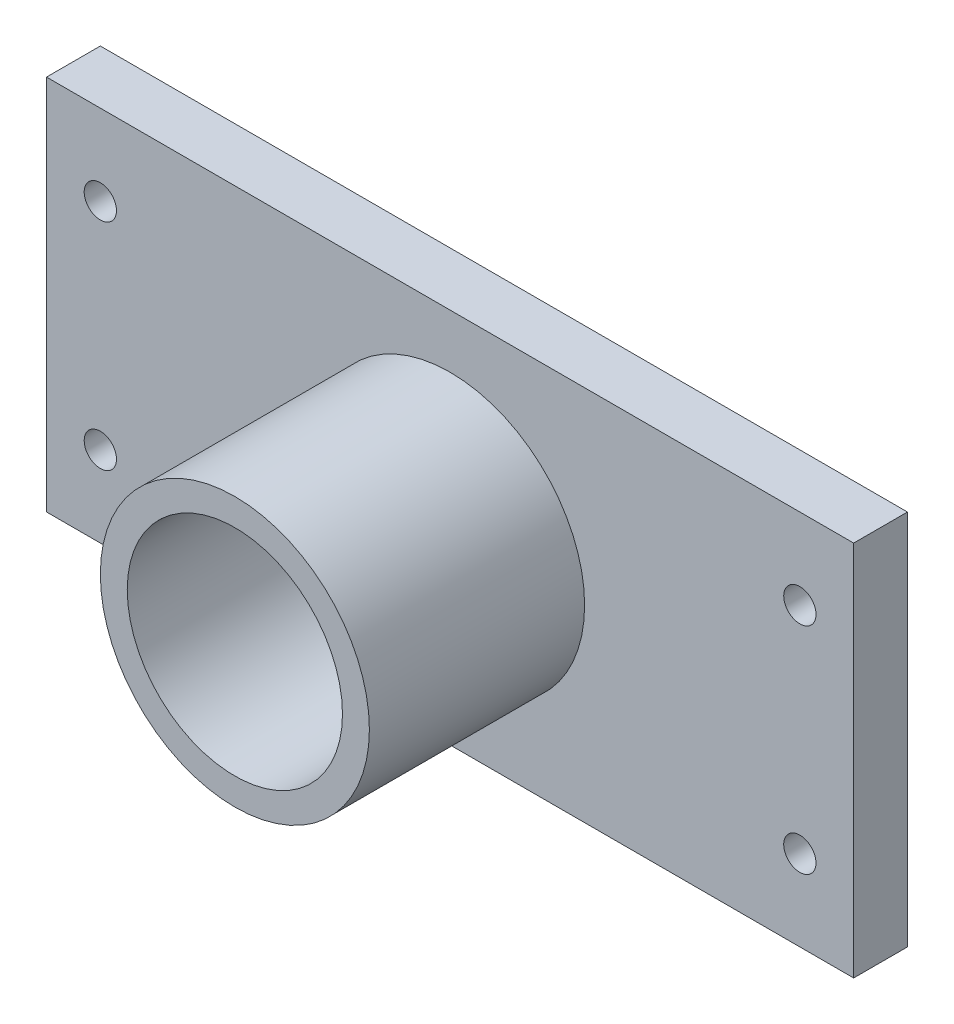
ISO-10303-21;
HEADER;
FILE_DESCRIPTION(('STEP AP214'),'2;1');
FILE_NAME('part.step','',(''),(''),'','','');
FILE_SCHEMA(('AUTOMOTIVE_DESIGN { 1 0 10303 214 1 1 1 1 }'));
ENDSEC;
DATA;
#1=APPLICATION_CONTEXT('core data for automotive mechanical design processes');
#2=APPLICATION_PROTOCOL_DEFINITION('international standard','automotive_design',2000,#1);
#3=PRODUCT_CONTEXT('',#1,'mechanical');
#4=PRODUCT('Part','Part','',(#3));
#5=PRODUCT_RELATED_PRODUCT_CATEGORY('part','',(#4));
#6=PRODUCT_DEFINITION_FORMATION('','',#4);
#7=PRODUCT_DEFINITION_CONTEXT('part definition',#1,'design');
#8=PRODUCT_DEFINITION('design','',#6,#7);
#9=PRODUCT_DEFINITION_SHAPE('','',#8);
#10=(LENGTH_UNIT() NAMED_UNIT(*) SI_UNIT(.MILLI.,.METRE.));
#11=(NAMED_UNIT(*) PLANE_ANGLE_UNIT() SI_UNIT($,.RADIAN.));
#12=(NAMED_UNIT(*) SI_UNIT($,.STERADIAN.) SOLID_ANGLE_UNIT());
#13=UNCERTAINTY_MEASURE_WITH_UNIT(LENGTH_MEASURE(1.E-05),#10,'distance_accuracy_value','');
#14=(GEOMETRIC_REPRESENTATION_CONTEXT(3) GLOBAL_UNCERTAINTY_ASSIGNED_CONTEXT((#13)) GLOBAL_UNIT_ASSIGNED_CONTEXT((#10,
#11,#12)) REPRESENTATION_CONTEXT('',''));
#15=CARTESIAN_POINT('',(0.,0.,0.));
#16=DIRECTION('',(0.,0.,1.));
#17=DIRECTION('',(1.,0.,0.));
#18=AXIS2_PLACEMENT_3D('',#15,#16,#17);
#19=CARTESIAN_POINT('',(0.,0.,10.));
#20=DIRECTION('',(0.,0.,1.));
#21=DIRECTION('',(1.,0.,0.));
#22=AXIS2_PLACEMENT_3D('',#19,#20,#21);
#23=PLANE('',#22);
#24=CARTESIAN_POINT('',(-65.,-20.,10.));
#25=DIRECTION('',(0.,0.,1.));
#26=DIRECTION('',(-1.,0.,0.));
#27=AXIS2_PLACEMENT_3D('',#24,#25,#26);
#28=CIRCLE('',#27,3.);
#29=CARTESIAN_POINT('',(-68.,-20.,10.));
#30=VERTEX_POINT('',#29);
#31=EDGE_CURVE('E162',#30,#30,#28,.T.);
#32=ORIENTED_EDGE('',*,*,#31,.F.);
#33=EDGE_LOOP('',(#32));
#34=FACE_BOUND('',#33,.T.);
#35=CARTESIAN_POINT('',(65.,-20.,10.));
#36=DIRECTION('',(0.,0.,1.));
#37=DIRECTION('',(1.,0.,0.));
#38=AXIS2_PLACEMENT_3D('',#35,#36,#37);
#39=CIRCLE('',#38,3.);
#40=CARTESIAN_POINT('',(68.,-20.,10.));
#41=VERTEX_POINT('',#40);
#42=EDGE_CURVE('E156',#41,#41,#39,.T.);
#43=ORIENTED_EDGE('',*,*,#42,.F.);
#44=EDGE_LOOP('',(#43));
#45=FACE_BOUND('',#44,.T.);
#46=CARTESIAN_POINT('',(65.,20.,10.));
#47=DIRECTION('',(0.,0.,1.));
#48=DIRECTION('',(-1.,0.,0.));
#49=AXIS2_PLACEMENT_3D('',#46,#47,#48);
#50=CIRCLE('',#49,3.);
#51=CARTESIAN_POINT('',(62.,20.,10.));
#52=VERTEX_POINT('',#51);
#53=EDGE_CURVE('E150',#52,#52,#50,.T.);
#54=ORIENTED_EDGE('',*,*,#53,.F.);
#55=EDGE_LOOP('',(#54));
#56=FACE_BOUND('',#55,.T.);
#57=CARTESIAN_POINT('',(-65.,20.,10.));
#58=DIRECTION('',(0.,0.,1.));
#59=DIRECTION('',(1.,0.,0.));
#60=AXIS2_PLACEMENT_3D('',#57,#58,#59);
#61=CIRCLE('',#60,3.);
#62=CARTESIAN_POINT('',(-62.,20.,10.));
#63=VERTEX_POINT('',#62);
#64=EDGE_CURVE('E144',#63,#63,#61,.T.);
#65=ORIENTED_EDGE('',*,*,#64,.F.);
#66=EDGE_LOOP('',(#65));
#67=FACE_BOUND('',#66,.T.);
#68=DIRECTION('',(-1.,0.,0.));
#69=VECTOR('',#68,1.);
#70=CARTESIAN_POINT('',(0.,35.,10.));
#71=LINE('',#70,#69);
#72=CARTESIAN_POINT('',(75.,35.,10.));
#73=VERTEX_POINT('',#72);
#74=CARTESIAN_POINT('',(-75.,35.,10.));
#75=VERTEX_POINT('',#74);
#76=EDGE_CURVE('E105',#73,#75,#71,.T.);
#77=ORIENTED_EDGE('',*,*,#76,.T.);
#78=DIRECTION('',(0.,-1.,0.));
#79=VECTOR('',#78,1.);
#80=CARTESIAN_POINT('',(-75.,0.,10.));
#81=LINE('',#80,#79);
#82=CARTESIAN_POINT('',(-75.,-35.,10.));
#83=VERTEX_POINT('',#82);
#84=EDGE_CURVE('E97',#75,#83,#81,.T.);
#85=ORIENTED_EDGE('',*,*,#84,.T.);
#86=DIRECTION('',(-1.,0.,0.));
#87=VECTOR('',#86,1.);
#88=CARTESIAN_POINT('',(0.,-35.,10.));
#89=LINE('',#88,#87);
#90=CARTESIAN_POINT('',(75.,-35.,10.));
#91=VERTEX_POINT('',#90);
#92=EDGE_CURVE('E104',#91,#83,#89,.T.);
#93=ORIENTED_EDGE('',*,*,#92,.F.);
#94=DIRECTION('',(0.,-1.,0.));
#95=VECTOR('',#94,1.);
#96=CARTESIAN_POINT('',(75.,0.,10.));
#97=LINE('',#96,#95);
#98=EDGE_CURVE('E114',#73,#91,#97,.T.);
#99=ORIENTED_EDGE('',*,*,#98,.F.);
#100=EDGE_LOOP('',(#77,#85,#93,#99));
#101=FACE_BOUND('',#100,.T.);
#102=CARTESIAN_POINT('',(0.,0.,10.));
#103=DIRECTION('',(0.,0.,1.));
#104=DIRECTION('',(1.,0.,0.));
#105=AXIS2_PLACEMENT_3D('',#102,#103,#104);
#106=CIRCLE('',#105,25.);
#107=CARTESIAN_POINT('',(25.,0.,10.));
#108=VERTEX_POINT('',#107);
#109=EDGE_CURVE('E135',#108,#108,#106,.T.);
#110=ORIENTED_EDGE('',*,*,#109,.F.);
#111=EDGE_LOOP('',(#110));
#112=FACE_BOUND('',#111,.T.);
#113=ADVANCED_FACE('F55',(#34,#45,#56,#67,#101,#112),#23,.T.);
#114=CARTESIAN_POINT('',(0.,35.,10.));
#115=DIRECTION('',(0.,-1.,0.));
#116=DIRECTION('',(1.,0.,0.));
#117=AXIS2_PLACEMENT_3D('',#114,#115,#116);
#118=PLANE('',#117);
#119=DIRECTION('',(-1.,0.,0.));
#120=VECTOR('',#119,1.);
#121=CARTESIAN_POINT('',(0.,35.,0.));
#122=LINE('',#121,#120);
#123=CARTESIAN_POINT('',(75.,35.,0.));
#124=VERTEX_POINT('',#123);
#125=CARTESIAN_POINT('',(-75.,35.,0.));
#126=VERTEX_POINT('',#125);
#127=EDGE_CURVE('E119',#124,#126,#122,.T.);
#128=ORIENTED_EDGE('',*,*,#127,.T.);
#129=DIRECTION('',(0.,0.,-1.));
#130=VECTOR('',#129,1.);
#131=CARTESIAN_POINT('',(-75.,35.,10.));
#132=LINE('',#131,#130);
#133=EDGE_CURVE('E12',#75,#126,#132,.T.);
#134=ORIENTED_EDGE('',*,*,#133,.F.);
#135=ORIENTED_EDGE('',*,*,#76,.F.);
#136=DIRECTION('',(0.,0.,-1.));
#137=VECTOR('',#136,1.);
#138=CARTESIAN_POINT('',(75.,35.,10.));
#139=LINE('',#138,#137);
#140=EDGE_CURVE('E72',#73,#124,#139,.T.);
#141=ORIENTED_EDGE('',*,*,#140,.T.);
#142=EDGE_LOOP('',(#128,#134,#135,#141));
#143=FACE_BOUND('',#142,.T.);
#144=ADVANCED_FACE('F57',(#143),#118,.F.);
#145=CARTESIAN_POINT('',(-75.,0.,10.));
#146=DIRECTION('',(1.,0.,0.));
#147=DIRECTION('',(0.,1.,0.));
#148=AXIS2_PLACEMENT_3D('',#145,#146,#147);
#149=PLANE('',#148);
#150=DIRECTION('',(0.,-1.,0.));
#151=VECTOR('',#150,1.);
#152=CARTESIAN_POINT('',(-75.,0.,0.));
#153=LINE('',#152,#151);
#154=CARTESIAN_POINT('',(-75.,-35.,0.));
#155=VERTEX_POINT('',#154);
#156=EDGE_CURVE('E110',#126,#155,#153,.T.);
#157=ORIENTED_EDGE('',*,*,#156,.T.);
#158=DIRECTION('',(0.,0.,-1.));
#159=VECTOR('',#158,1.);
#160=CARTESIAN_POINT('',(-75.,-35.,10.));
#161=LINE('',#160,#159);
#162=EDGE_CURVE('E64',#83,#155,#161,.T.);
#163=ORIENTED_EDGE('',*,*,#162,.F.);
#164=ORIENTED_EDGE('',*,*,#84,.F.);
#165=ORIENTED_EDGE('',*,*,#133,.T.);
#166=EDGE_LOOP('',(#157,#163,#164,#165));
#167=FACE_BOUND('',#166,.T.);
#168=ADVANCED_FACE('F109',(#167),#149,.F.);
#169=CARTESIAN_POINT('',(0.,-35.,10.));
#170=DIRECTION('',(0.,-1.,0.));
#171=DIRECTION('',(1.,0.,0.));
#172=AXIS2_PLACEMENT_3D('',#169,#170,#171);
#173=PLANE('',#172);
#174=DIRECTION('',(-1.,0.,0.));
#175=VECTOR('',#174,1.);
#176=CARTESIAN_POINT('',(0.,-35.,0.));
#177=LINE('',#176,#175);
#178=CARTESIAN_POINT('',(75.,-35.,0.));
#179=VERTEX_POINT('',#178);
#180=EDGE_CURVE('E123',#179,#155,#177,.T.);
#181=ORIENTED_EDGE('',*,*,#180,.F.);
#182=DIRECTION('',(0.,0.,-1.));
#183=VECTOR('',#182,1.);
#184=CARTESIAN_POINT('',(75.,-35.,10.));
#185=LINE('',#184,#183);
#186=EDGE_CURVE('E86',#91,#179,#185,.T.);
#187=ORIENTED_EDGE('',*,*,#186,.F.);
#188=ORIENTED_EDGE('',*,*,#92,.T.);
#189=ORIENTED_EDGE('',*,*,#162,.T.);
#190=EDGE_LOOP('',(#181,#187,#188,#189));
#191=FACE_BOUND('',#190,.T.);
#192=ADVANCED_FACE('F113',(#191),#173,.T.);
#193=CARTESIAN_POINT('',(75.,0.,10.));
#194=DIRECTION('',(1.,0.,0.));
#195=DIRECTION('',(0.,1.,0.));
#196=AXIS2_PLACEMENT_3D('',#193,#194,#195);
#197=PLANE('',#196);
#198=DIRECTION('',(0.,-1.,0.));
#199=VECTOR('',#198,1.);
#200=CARTESIAN_POINT('',(75.,0.,0.));
#201=LINE('',#200,#199);
#202=EDGE_CURVE('E125',#124,#179,#201,.T.);
#203=ORIENTED_EDGE('',*,*,#202,.F.);
#204=ORIENTED_EDGE('',*,*,#140,.F.);
#205=ORIENTED_EDGE('',*,*,#98,.T.);
#206=ORIENTED_EDGE('',*,*,#186,.T.);
#207=EDGE_LOOP('',(#203,#204,#205,#206));
#208=FACE_BOUND('',#207,.T.);
#209=ADVANCED_FACE('F213',(#208),#197,.T.);
#210=CARTESIAN_POINT('',(0.,0.,10.));
#211=DIRECTION('',(0.,0.,-1.));
#212=DIRECTION('',(-1.,0.,0.));
#213=AXIS2_PLACEMENT_3D('',#210,#211,#212);
#214=CYLINDRICAL_SURFACE('',#213,20.);
#215=CARTESIAN_POINT('',(0.,0.,0.));
#216=DIRECTION('',(0.,0.,1.));
#217=DIRECTION('',(1.,0.,0.));
#218=AXIS2_PLACEMENT_3D('',#215,#216,#217);
#219=CIRCLE('',#218,20.);
#220=CARTESIAN_POINT('',(20.,0.,0.));
#221=VERTEX_POINT('',#220);
#222=EDGE_CURVE('E128',#221,#221,#219,.T.);
#223=ORIENTED_EDGE('',*,*,#222,.F.);
#224=EDGE_LOOP('',(#223));
#225=FACE_BOUND('',#224,.T.);
#226=CARTESIAN_POINT('',(0.,0.,50.));
#227=DIRECTION('',(0.,0.,1.));
#228=DIRECTION('',(1.,0.,0.));
#229=AXIS2_PLACEMENT_3D('',#226,#227,#228);
#230=CIRCLE('',#229,20.);
#231=CARTESIAN_POINT('',(20.,0.,50.));
#232=VERTEX_POINT('',#231);
#233=EDGE_CURVE('E138',#232,#232,#230,.T.);
#234=ORIENTED_EDGE('',*,*,#233,.T.);
#235=EDGE_LOOP('',(#234));
#236=FACE_BOUND('',#235,.T.);
#237=ADVANCED_FACE('F210',(#225,#236),#214,.F.);
#238=CARTESIAN_POINT('',(0.,0.,0.));
#239=DIRECTION('',(0.,0.,1.));
#240=DIRECTION('',(1.,0.,0.));
#241=AXIS2_PLACEMENT_3D('',#238,#239,#240);
#242=PLANE('',#241);
#243=CARTESIAN_POINT('',(-65.,-20.,0.));
#244=DIRECTION('',(0.,0.,1.));
#245=DIRECTION('',(-1.,0.,0.));
#246=AXIS2_PLACEMENT_3D('',#243,#244,#245);
#247=CIRCLE('',#246,3.);
#248=CARTESIAN_POINT('',(-68.,-20.,0.));
#249=VERTEX_POINT('',#248);
#250=EDGE_CURVE('E147',#249,#249,#247,.T.);
#251=ORIENTED_EDGE('',*,*,#250,.T.);
#252=EDGE_LOOP('',(#251));
#253=FACE_BOUND('',#252,.T.);
#254=CARTESIAN_POINT('',(65.,-20.,0.));
#255=DIRECTION('',(0.,0.,1.));
#256=DIRECTION('',(1.,0.,0.));
#257=AXIS2_PLACEMENT_3D('',#254,#255,#256);
#258=CIRCLE('',#257,3.);
#259=CARTESIAN_POINT('',(68.,-20.,0.));
#260=VERTEX_POINT('',#259);
#261=EDGE_CURVE('E159',#260,#260,#258,.T.);
#262=ORIENTED_EDGE('',*,*,#261,.T.);
#263=EDGE_LOOP('',(#262));
#264=FACE_BOUND('',#263,.T.);
#265=CARTESIAN_POINT('',(65.,20.,0.));
#266=DIRECTION('',(0.,0.,1.));
#267=DIRECTION('',(-1.,0.,0.));
#268=AXIS2_PLACEMENT_3D('',#265,#266,#267);
#269=CIRCLE('',#268,3.);
#270=CARTESIAN_POINT('',(62.,20.,0.));
#271=VERTEX_POINT('',#270);
#272=EDGE_CURVE('E153',#271,#271,#269,.T.);
#273=ORIENTED_EDGE('',*,*,#272,.T.);
#274=EDGE_LOOP('',(#273));
#275=FACE_BOUND('',#274,.T.);
#276=CARTESIAN_POINT('',(-65.,20.,0.));
#277=DIRECTION('',(0.,0.,1.));
#278=DIRECTION('',(1.,0.,0.));
#279=AXIS2_PLACEMENT_3D('',#276,#277,#278);
#280=CIRCLE('',#279,3.);
#281=CARTESIAN_POINT('',(-62.,20.,0.));
#282=VERTEX_POINT('',#281);
#283=EDGE_CURVE('E143',#282,#282,#280,.T.);
#284=ORIENTED_EDGE('',*,*,#283,.T.);
#285=EDGE_LOOP('',(#284));
#286=FACE_BOUND('',#285,.T.);
#287=ORIENTED_EDGE('',*,*,#127,.F.);
#288=ORIENTED_EDGE('',*,*,#202,.T.);
#289=ORIENTED_EDGE('',*,*,#180,.T.);
#290=ORIENTED_EDGE('',*,*,#156,.F.);
#291=EDGE_LOOP('',(#287,#288,#289,#290));
#292=FACE_BOUND('',#291,.T.);
#293=ORIENTED_EDGE('',*,*,#222,.T.);
#294=EDGE_LOOP('',(#293));
#295=FACE_BOUND('',#294,.T.);
#296=ADVANCED_FACE('F168',(#253,#264,#275,#286,#292,#295),#242,.F.);
#297=CARTESIAN_POINT('',(0.,0.,50.));
#298=DIRECTION('',(0.,0.,1.));
#299=DIRECTION('',(1.,0.,0.));
#300=AXIS2_PLACEMENT_3D('',#297,#298,#299);
#301=PLANE('',#300);
#302=CARTESIAN_POINT('',(0.,0.,50.));
#303=DIRECTION('',(0.,0.,1.));
#304=DIRECTION('',(1.,0.,0.));
#305=AXIS2_PLACEMENT_3D('',#302,#303,#304);
#306=CIRCLE('',#305,25.);
#307=CARTESIAN_POINT('',(25.,0.,50.));
#308=VERTEX_POINT('',#307);
#309=EDGE_CURVE('E121',#308,#308,#306,.T.);
#310=ORIENTED_EDGE('',*,*,#309,.T.);
#311=EDGE_LOOP('',(#310));
#312=FACE_BOUND('',#311,.T.);
#313=ORIENTED_EDGE('',*,*,#233,.F.);
#314=EDGE_LOOP('',(#313));
#315=FACE_BOUND('',#314,.T.);
#316=ADVANCED_FACE('F199',(#312,#315),#301,.T.);
#317=CARTESIAN_POINT('',(0.,0.,50.));
#318=DIRECTION('',(0.,0.,-1.));
#319=DIRECTION('',(-1.,0.,0.));
#320=AXIS2_PLACEMENT_3D('',#317,#318,#319);
#321=CYLINDRICAL_SURFACE('',#320,25.);
#322=ORIENTED_EDGE('',*,*,#309,.F.);
#323=EDGE_LOOP('',(#322));
#324=FACE_BOUND('',#323,.T.);
#325=ORIENTED_EDGE('',*,*,#109,.T.);
#326=EDGE_LOOP('',(#325));
#327=FACE_BOUND('',#326,.T.);
#328=ADVANCED_FACE('F190',(#324,#327),#321,.T.);
#329=CARTESIAN_POINT('',(-65.,20.,0.));
#330=DIRECTION('',(0.,0.,1.));
#331=DIRECTION('',(1.,0.,0.));
#332=AXIS2_PLACEMENT_3D('',#329,#330,#331);
#333=CYLINDRICAL_SURFACE('',#332,3.);
#334=ORIENTED_EDGE('',*,*,#283,.F.);
#335=EDGE_LOOP('',(#334));
#336=FACE_BOUND('',#335,.T.);
#337=ORIENTED_EDGE('',*,*,#64,.T.);
#338=EDGE_LOOP('',(#337));
#339=FACE_BOUND('',#338,.T.);
#340=ADVANCED_FACE('F187',(#336,#339),#333,.F.);
#341=CARTESIAN_POINT('',(65.,20.,0.));
#342=DIRECTION('',(0.,0.,1.));
#343=DIRECTION('',(1.,0.,0.));
#344=AXIS2_PLACEMENT_3D('',#341,#342,#343);
#345=CYLINDRICAL_SURFACE('',#344,3.);
#346=ORIENTED_EDGE('',*,*,#272,.F.);
#347=EDGE_LOOP('',(#346));
#348=FACE_BOUND('',#347,.T.);
#349=ORIENTED_EDGE('',*,*,#53,.T.);
#350=EDGE_LOOP('',(#349));
#351=FACE_BOUND('',#350,.T.);
#352=ADVANCED_FACE('F189',(#348,#351),#345,.F.);
#353=CARTESIAN_POINT('',(65.,-20.,0.));
#354=DIRECTION('',(0.,0.,1.));
#355=DIRECTION('',(1.,0.,0.));
#356=AXIS2_PLACEMENT_3D('',#353,#354,#355);
#357=CYLINDRICAL_SURFACE('',#356,3.);
#358=ORIENTED_EDGE('',*,*,#261,.F.);
#359=EDGE_LOOP('',(#358));
#360=FACE_BOUND('',#359,.T.);
#361=ORIENTED_EDGE('',*,*,#42,.T.);
#362=EDGE_LOOP('',(#361));
#363=FACE_BOUND('',#362,.T.);
#364=ADVANCED_FACE('F174',(#360,#363),#357,.F.);
#365=CARTESIAN_POINT('',(-65.,-20.,0.));
#366=DIRECTION('',(0.,0.,1.));
#367=DIRECTION('',(1.,0.,0.));
#368=AXIS2_PLACEMENT_3D('',#365,#366,#367);
#369=CYLINDRICAL_SURFACE('',#368,3.);
#370=ORIENTED_EDGE('',*,*,#250,.F.);
#371=EDGE_LOOP('',(#370));
#372=FACE_BOUND('',#371,.T.);
#373=ORIENTED_EDGE('',*,*,#31,.T.);
#374=EDGE_LOOP('',(#373));
#375=FACE_BOUND('',#374,.T.);
#376=ADVANCED_FACE('F171',(#372,#375),#369,.F.);
#377=CLOSED_SHELL('',(#113,#144,#168,#192,#209,#237,#296,#316,#328,#340,#352,#364,#376));
#378=MANIFOLD_SOLID_BREP('B2',#377);
#379=ADVANCED_BREP_SHAPE_REPRESENTATION('',(#18,#378),#14);
#380=SHAPE_DEFINITION_REPRESENTATION(#9,#379);
ENDSEC;
END-ISO-10303-21;
